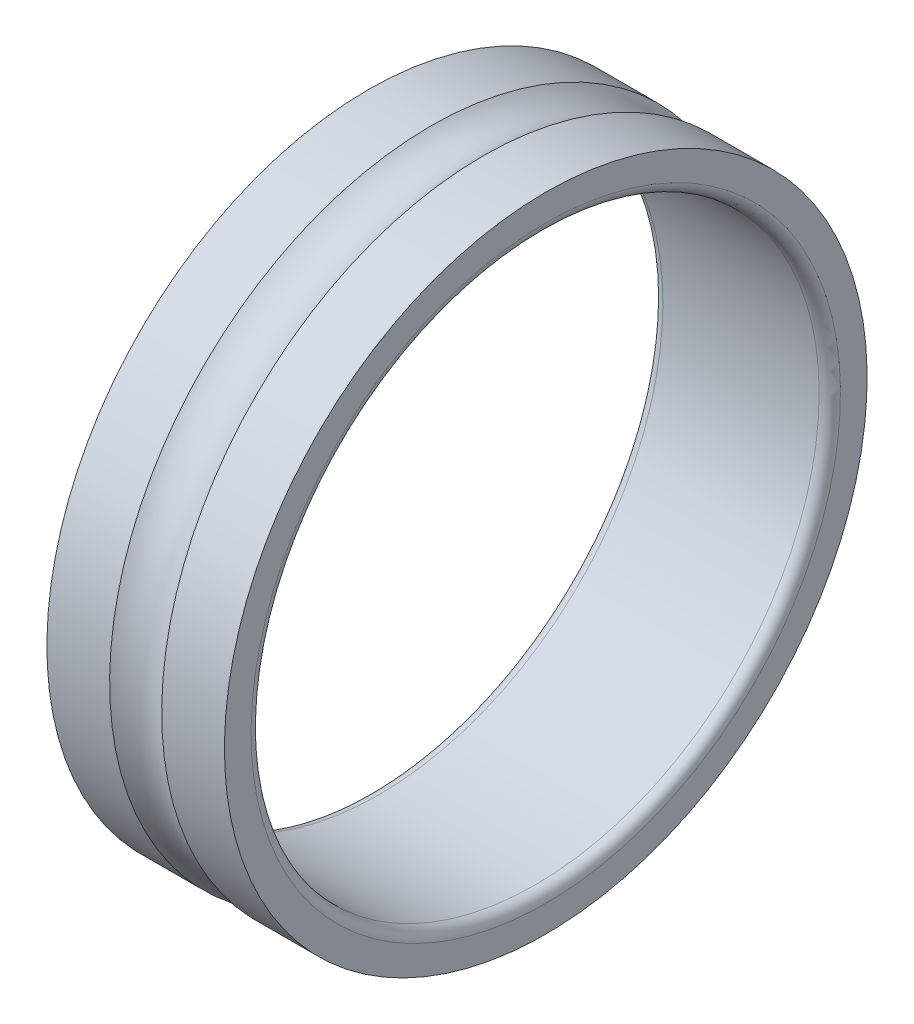
ISO-10303-21;
HEADER;
FILE_DESCRIPTION(('STEP AP214'),'2;1');
FILE_NAME('part.step','',(''),(''),'','','');
FILE_SCHEMA(('AUTOMOTIVE_DESIGN { 1 0 10303 214 1 1 1 1 }'));
ENDSEC;
DATA;
#1=APPLICATION_CONTEXT('core data for automotive mechanical design processes');
#2=APPLICATION_PROTOCOL_DEFINITION('international standard','automotive_design',2000,#1);
#3=PRODUCT_CONTEXT('',#1,'mechanical');
#4=PRODUCT('Part','Part','',(#3));
#5=PRODUCT_RELATED_PRODUCT_CATEGORY('part','',(#4));
#6=PRODUCT_DEFINITION_FORMATION('','',#4);
#7=PRODUCT_DEFINITION_CONTEXT('part definition',#1,'design');
#8=PRODUCT_DEFINITION('design','',#6,#7);
#9=PRODUCT_DEFINITION_SHAPE('','',#8);
#10=(LENGTH_UNIT() NAMED_UNIT(*) SI_UNIT(.MILLI.,.METRE.));
#11=(NAMED_UNIT(*) PLANE_ANGLE_UNIT() SI_UNIT($,.RADIAN.));
#12=(NAMED_UNIT(*) SI_UNIT($,.STERADIAN.) SOLID_ANGLE_UNIT());
#13=UNCERTAINTY_MEASURE_WITH_UNIT(LENGTH_MEASURE(1.E-05),#10,'distance_accuracy_value','');
#14=(GEOMETRIC_REPRESENTATION_CONTEXT(3) GLOBAL_UNCERTAINTY_ASSIGNED_CONTEXT((#13)) GLOBAL_UNIT_ASSIGNED_CONTEXT((#10,
#11,#12)) REPRESENTATION_CONTEXT('',''));
#15=CARTESIAN_POINT('',(0.,0.,0.));
#16=DIRECTION('',(0.,0.,1.));
#17=DIRECTION('',(1.,0.,0.));
#18=AXIS2_PLACEMENT_3D('',#15,#16,#17);
#19=CARTESIAN_POINT('',(2.05828597873269,0.,0.));
#20=DIRECTION('',(-1.,0.,0.));
#21=DIRECTION('',(0.,1.,0.));
#22=AXIS2_PLACEMENT_3D('',#19,#20,#21);
#23=CYLINDRICAL_SURFACE('',#22,4.525);
#24=CARTESIAN_POINT('',(1.61657195746537,0.,0.));
#25=DIRECTION('',(1.,0.,0.));
#26=DIRECTION('',(0.,1.,0.));
#27=AXIS2_PLACEMENT_3D('',#24,#25,#26);
#28=CIRCLE('',#27,4.525);
#29=CARTESIAN_POINT('',(1.61657195746537,4.525,0.));
#30=VERTEX_POINT('',#29);
#31=EDGE_CURVE('E11',#30,#30,#28,.T.);
#32=ORIENTED_EDGE('',*,*,#31,.T.);
#33=EDGE_LOOP('',(#32));
#34=FACE_BOUND('',#33,.T.);
#35=CARTESIAN_POINT('',(2.5,0.,0.));
#36=DIRECTION('',(1.,0.,0.));
#37=DIRECTION('',(0.,1.,0.));
#38=AXIS2_PLACEMENT_3D('',#35,#36,#37);
#39=CIRCLE('',#38,4.525);
#40=CARTESIAN_POINT('',(2.5,4.525,0.));
#41=VERTEX_POINT('',#40);
#42=EDGE_CURVE('E57',#41,#41,#39,.T.);
#43=ORIENTED_EDGE('',*,*,#42,.F.);
#44=EDGE_LOOP('',(#43));
#45=FACE_BOUND('',#44,.T.);
#46=ADVANCED_FACE('F16',(#34,#45),#23,.T.);
#47=CARTESIAN_POINT('',(1.25,0.,0.));
#48=DIRECTION('',(1.,0.,0.));
#49=DIRECTION('',(0.,0.,-1.));
#50=AXIS2_PLACEMENT_3D('',#47,#48,#49);
#51=TOROIDAL_SURFACE('',#50,5.,0.6);
#52=CARTESIAN_POINT('',(0.883428042534624,0.,0.));
#53=DIRECTION('',(1.,0.,0.));
#54=DIRECTION('',(0.,1.,0.));
#55=AXIS2_PLACEMENT_3D('',#52,#53,#54);
#56=CIRCLE('',#55,4.525);
#57=CARTESIAN_POINT('',(0.883428042534624,4.525,0.));
#58=VERTEX_POINT('',#57);
#59=EDGE_CURVE('E25',#58,#58,#56,.T.);
#60=ORIENTED_EDGE('',*,*,#59,.T.);
#61=EDGE_LOOP('',(#60));
#62=FACE_BOUND('',#61,.T.);
#63=ORIENTED_EDGE('',*,*,#31,.F.);
#64=EDGE_LOOP('',(#63));
#65=FACE_BOUND('',#64,.T.);
#66=ADVANCED_FACE('F82',(#62,#65),#51,.F.);
#67=CARTESIAN_POINT('',(0.441714021267312,0.,0.));
#68=DIRECTION('',(-1.,0.,0.));
#69=DIRECTION('',(0.,1.,0.));
#70=AXIS2_PLACEMENT_3D('',#67,#68,#69);
#71=CYLINDRICAL_SURFACE('',#70,4.525);
#72=CARTESIAN_POINT('',(0.,0.,0.));
#73=DIRECTION('',(1.,0.,0.));
#74=DIRECTION('',(0.,1.,0.));
#75=AXIS2_PLACEMENT_3D('',#72,#73,#74);
#76=CIRCLE('',#75,4.525);
#77=CARTESIAN_POINT('',(0.,4.525,0.));
#78=VERTEX_POINT('',#77);
#79=EDGE_CURVE('E48',#78,#78,#76,.T.);
#80=ORIENTED_EDGE('',*,*,#79,.T.);
#81=EDGE_LOOP('',(#80));
#82=FACE_BOUND('',#81,.T.);
#83=ORIENTED_EDGE('',*,*,#59,.F.);
#84=EDGE_LOOP('',(#83));
#85=FACE_BOUND('',#84,.T.);
#86=ADVANCED_FACE('F49',(#82,#85),#71,.T.);
#87=CARTESIAN_POINT('',(0.,4.3375,0.));
#88=DIRECTION('',(-1.,0.,0.));
#89=DIRECTION('',(0.,-1.,0.));
#90=AXIS2_PLACEMENT_3D('',#87,#88,#89);
#91=PLANE('',#90);
#92=CARTESIAN_POINT('',(0.,0.,0.));
#93=DIRECTION('',(1.,0.,0.));
#94=DIRECTION('',(0.,1.,0.));
#95=AXIS2_PLACEMENT_3D('',#92,#93,#94);
#96=CIRCLE('',#95,4.15);
#97=CARTESIAN_POINT('',(0.,4.15,0.));
#98=VERTEX_POINT('',#97);
#99=EDGE_CURVE('E52',#98,#98,#96,.T.);
#100=ORIENTED_EDGE('',*,*,#99,.T.);
#101=EDGE_LOOP('',(#100));
#102=FACE_BOUND('',#101,.T.);
#103=ORIENTED_EDGE('',*,*,#79,.F.);
#104=EDGE_LOOP('',(#103));
#105=FACE_BOUND('',#104,.T.);
#106=ADVANCED_FACE('F92',(#102,#105),#91,.T.);
#107=CARTESIAN_POINT('',(0.15,0.,0.));
#108=DIRECTION('',(1.,0.,0.));
#109=DIRECTION('',(0.,0.,-1.));
#110=AXIS2_PLACEMENT_3D('',#107,#108,#109);
#111=TOROIDAL_SURFACE('',#110,4.15,0.15);
#112=CARTESIAN_POINT('',(0.15,0.,0.));
#113=DIRECTION('',(1.,0.,0.));
#114=DIRECTION('',(0.,1.,0.));
#115=AXIS2_PLACEMENT_3D('',#112,#113,#114);
#116=CIRCLE('',#115,4.);
#117=CARTESIAN_POINT('',(0.15,4.,0.));
#118=VERTEX_POINT('',#117);
#119=EDGE_CURVE('E54',#118,#118,#116,.T.);
#120=ORIENTED_EDGE('',*,*,#119,.T.);
#121=EDGE_LOOP('',(#120));
#122=FACE_BOUND('',#121,.T.);
#123=ORIENTED_EDGE('',*,*,#99,.F.);
#124=EDGE_LOOP('',(#123));
#125=FACE_BOUND('',#124,.T.);
#126=ADVANCED_FACE('F79',(#122,#125),#111,.T.);
#127=CARTESIAN_POINT('',(1.25,0.,0.));
#128=DIRECTION('',(-1.,0.,0.));
#129=DIRECTION('',(0.,1.,0.));
#130=AXIS2_PLACEMENT_3D('',#127,#128,#129);
#131=CYLINDRICAL_SURFACE('',#130,4.);
#132=CARTESIAN_POINT('',(2.35,0.,0.));
#133=DIRECTION('',(1.,0.,0.));
#134=DIRECTION('',(0.,1.,0.));
#135=AXIS2_PLACEMENT_3D('',#132,#133,#134);
#136=CIRCLE('',#135,4.);
#137=CARTESIAN_POINT('',(2.35,4.,0.));
#138=VERTEX_POINT('',#137);
#139=EDGE_CURVE('E59',#138,#138,#136,.T.);
#140=ORIENTED_EDGE('',*,*,#139,.T.);
#141=EDGE_LOOP('',(#140));
#142=FACE_BOUND('',#141,.T.);
#143=ORIENTED_EDGE('',*,*,#119,.F.);
#144=EDGE_LOOP('',(#143));
#145=FACE_BOUND('',#144,.T.);
#146=ADVANCED_FACE('F18',(#142,#145),#131,.F.);
#147=CARTESIAN_POINT('',(2.35,0.,0.));
#148=DIRECTION('',(1.,0.,0.));
#149=DIRECTION('',(0.,0.,-1.));
#150=AXIS2_PLACEMENT_3D('',#147,#148,#149);
#151=TOROIDAL_SURFACE('',#150,4.15,0.15);
#152=CARTESIAN_POINT('',(2.5,0.,0.));
#153=DIRECTION('',(1.,0.,0.));
#154=DIRECTION('',(0.,1.,0.));
#155=AXIS2_PLACEMENT_3D('',#152,#153,#154);
#156=CIRCLE('',#155,4.15);
#157=CARTESIAN_POINT('',(2.5,4.15,0.));
#158=VERTEX_POINT('',#157);
#159=EDGE_CURVE('E60',#158,#158,#156,.T.);
#160=ORIENTED_EDGE('',*,*,#159,.T.);
#161=EDGE_LOOP('',(#160));
#162=FACE_BOUND('',#161,.T.);
#163=ORIENTED_EDGE('',*,*,#139,.F.);
#164=EDGE_LOOP('',(#163));
#165=FACE_BOUND('',#164,.T.);
#166=ADVANCED_FACE('F68',(#162,#165),#151,.T.);
#167=CARTESIAN_POINT('',(2.5,4.3375,0.));
#168=DIRECTION('',(1.,0.,0.));
#169=DIRECTION('',(0.,1.,0.));
#170=AXIS2_PLACEMENT_3D('',#167,#168,#169);
#171=PLANE('',#170);
#172=ORIENTED_EDGE('',*,*,#42,.T.);
#173=EDGE_LOOP('',(#172));
#174=FACE_BOUND('',#173,.T.);
#175=ORIENTED_EDGE('',*,*,#159,.F.);
#176=EDGE_LOOP('',(#175));
#177=FACE_BOUND('',#176,.T.);
#178=ADVANCED_FACE('F70',(#174,#177),#171,.T.);
#179=CLOSED_SHELL('',(#46,#66,#86,#106,#126,#146,#166,#178));
#180=MANIFOLD_SOLID_BREP('B1',#179);
#181=ADVANCED_BREP_SHAPE_REPRESENTATION('',(#18,#180),#14);
#182=SHAPE_DEFINITION_REPRESENTATION(#9,#181);
ENDSEC;
END-ISO-10303-21;
